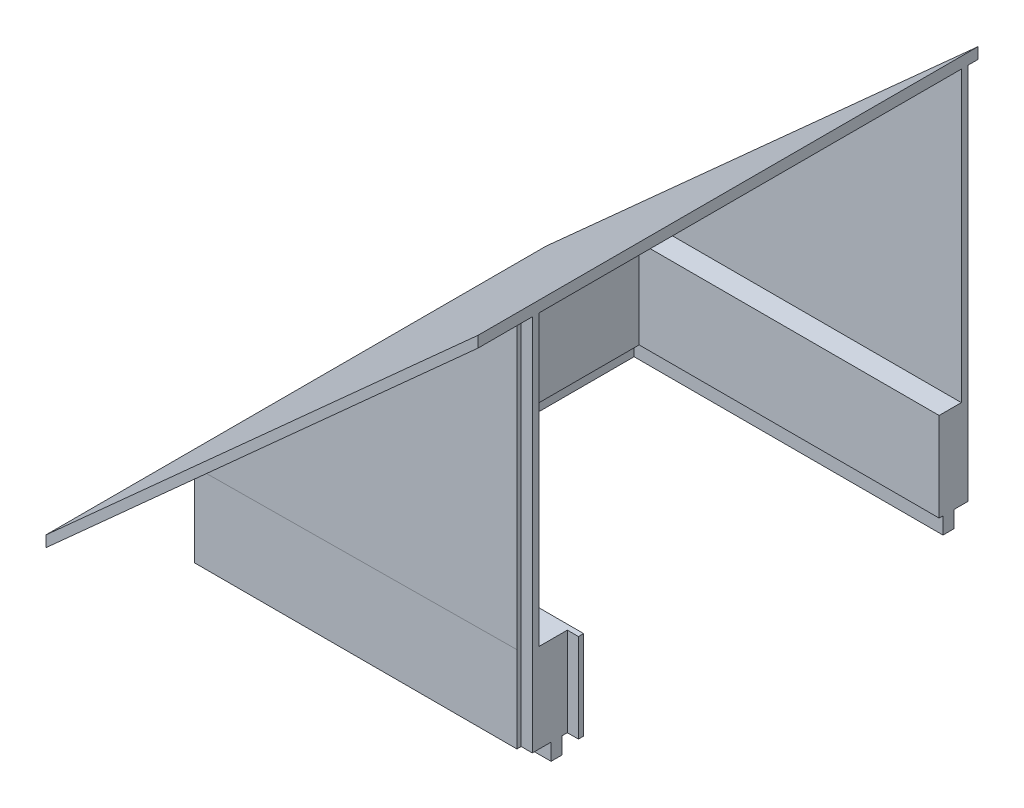
ISO-10303-21;
HEADER;
FILE_DESCRIPTION(('STEP AP214'),'2;1');
FILE_NAME('part.step','',(''),(''),'','','');
FILE_SCHEMA(('AUTOMOTIVE_DESIGN { 1 0 10303 214 1 1 1 1 }'));
ENDSEC;
DATA;
#1=APPLICATION_CONTEXT('core data for automotive mechanical design processes');
#2=APPLICATION_PROTOCOL_DEFINITION('international standard','automotive_design',2000,#1);
#3=PRODUCT_CONTEXT('',#1,'mechanical');
#4=PRODUCT('Part','Part','',(#3));
#5=PRODUCT_RELATED_PRODUCT_CATEGORY('part','',(#4));
#6=PRODUCT_DEFINITION_FORMATION('','',#4);
#7=PRODUCT_DEFINITION_CONTEXT('part definition',#1,'design');
#8=PRODUCT_DEFINITION('design','',#6,#7);
#9=PRODUCT_DEFINITION_SHAPE('','',#8);
#10=(LENGTH_UNIT() NAMED_UNIT(*) SI_UNIT(.MILLI.,.METRE.));
#11=(NAMED_UNIT(*) PLANE_ANGLE_UNIT() SI_UNIT($,.RADIAN.));
#12=(NAMED_UNIT(*) SI_UNIT($,.STERADIAN.) SOLID_ANGLE_UNIT());
#13=UNCERTAINTY_MEASURE_WITH_UNIT(LENGTH_MEASURE(1.E-05),#10,'distance_accuracy_value','');
#14=(GEOMETRIC_REPRESENTATION_CONTEXT(3) GLOBAL_UNCERTAINTY_ASSIGNED_CONTEXT((#13)) GLOBAL_UNIT_ASSIGNED_CONTEXT((#10,
#11,#12)) REPRESENTATION_CONTEXT('',''));
#15=CARTESIAN_POINT('',(0.,0.,0.));
#16=DIRECTION('',(0.,0.,1.));
#17=DIRECTION('',(1.,0.,0.));
#18=AXIS2_PLACEMENT_3D('',#15,#16,#17);
#19=CARTESIAN_POINT('',(24.3191489361702,0.,0.));
#20=DIRECTION('',(1.,0.,0.));
#21=DIRECTION('',(0.,0.,-1.));
#22=AXIS2_PLACEMENT_3D('',#19,#20,#21);
#23=PLANE('',#22);
#24=DIRECTION('',(0.,-1.,0.));
#25=VECTOR('',#24,1.);
#26=CARTESIAN_POINT('',(24.3191489361702,7.62,71.0236193905439));
#27=LINE('',#26,#25);
#28=CARTESIAN_POINT('',(24.3191489361702,7.62,71.0236193905439));
#29=VERTEX_POINT('',#28);
#30=CARTESIAN_POINT('',(24.3191489361702,-12.7,71.0236193905439));
#31=VERTEX_POINT('',#30);
#32=EDGE_CURVE('E50',#29,#31,#27,.T.);
#33=ORIENTED_EDGE('',*,*,#32,.F.);
#34=DIRECTION('',(0.,0.,-1.));
#35=VECTOR('',#34,1.);
#36=CARTESIAN_POINT('',(24.3191489361702,7.62,0.));
#37=LINE('',#36,#35);
#38=CARTESIAN_POINT('',(24.3191489361702,7.62,77.4653181557259));
#39=VERTEX_POINT('',#38);
#40=EDGE_CURVE('E476',#39,#29,#37,.T.);
#41=ORIENTED_EDGE('',*,*,#40,.F.);
#42=DIRECTION('',(0.,-0.99999991536576,-0.00041142249855091));
#43=VECTOR('',#42,1.);
#44=CARTESIAN_POINT('',(24.3191489361702,-0.0329146952814137,77.4621695741743));
#45=LINE('',#44,#43);
#46=CARTESIAN_POINT('',(24.3191489361703,73.66,77.4924884998297));
#47=VERTEX_POINT('',#46);
#48=EDGE_CURVE('E457',#47,#39,#45,.T.);
#49=ORIENTED_EDGE('',*,*,#48,.F.);
#50=DIRECTION('',(0.,0.,1.));
#51=VECTOR('',#50,1.);
#52=CARTESIAN_POINT('',(24.3191489361703,73.66,91.4350593905439));
#53=LINE('',#52,#51);
#54=CARTESIAN_POINT('',(24.3191489361702,73.6599999999999,-19.0549406094561));
#55=VERTEX_POINT('',#54);
#56=EDGE_CURVE('E366',#55,#47,#53,.T.);
#57=ORIENTED_EDGE('',*,*,#56,.F.);
#58=DIRECTION('',(0.,1.,0.));
#59=VECTOR('',#58,1.);
#60=CARTESIAN_POINT('',(24.3191489361702,0.,-19.0549406094561));
#61=LINE('',#60,#59);
#62=CARTESIAN_POINT('',(24.3191489361702,7.62,-19.0549406094561));
#63=VERTEX_POINT('',#62);
#64=EDGE_CURVE('E449',#63,#55,#61,.T.);
#65=ORIENTED_EDGE('',*,*,#64,.F.);
#66=CARTESIAN_POINT('',(24.3191489361702,7.62,-13.9749406094561));
#67=VERTEX_POINT('',#66);
#68=EDGE_CURVE('E470',#67,#63,#37,.T.);
#69=ORIENTED_EDGE('',*,*,#68,.F.);
#70=DIRECTION('',(0.,1.,0.));
#71=VECTOR('',#70,1.);
#72=CARTESIAN_POINT('',(24.3191489361702,7.62,-13.9749406094561));
#73=LINE('',#72,#71);
#74=CARTESIAN_POINT('',(24.3191489361702,-12.7,-13.9749406094561));
#75=VERTEX_POINT('',#74);
#76=EDGE_CURVE('E467',#75,#67,#73,.T.);
#77=ORIENTED_EDGE('',*,*,#76,.F.);
#78=DIRECTION('',(0.,0.,-1.));
#79=VECTOR('',#78,1.);
#80=CARTESIAN_POINT('',(24.3191489361702,-12.7,0.));
#81=LINE('',#80,#79);
#82=CARTESIAN_POINT('',(24.3191489361702,-12.7,-14.8568266094561));
#83=VERTEX_POINT('',#82);
#84=EDGE_CURVE('E486',#75,#83,#81,.T.);
#85=ORIENTED_EDGE('',*,*,#84,.T.);
#86=DIRECTION('',(0.,1.,0.));
#87=VECTOR('',#86,1.);
#88=CARTESIAN_POINT('',(24.3191489361702,-16.51,-14.8568266094561));
#89=LINE('',#88,#87);
#90=CARTESIAN_POINT('',(24.3191489361702,-16.51,-14.8568266094561));
#91=VERTEX_POINT('',#90);
#92=EDGE_CURVE('E454',#91,#83,#89,.T.);
#93=ORIENTED_EDGE('',*,*,#92,.F.);
#94=DIRECTION('',(0.,0.,1.));
#95=VECTOR('',#94,1.);
#96=CARTESIAN_POINT('',(24.3191489361702,-16.51,0.));
#97=LINE('',#96,#95);
#98=CARTESIAN_POINT('',(24.3191489361702,-16.51,-17.3968266094561));
#99=VERTEX_POINT('',#98);
#100=EDGE_CURVE('E459',#99,#91,#97,.T.);
#101=ORIENTED_EDGE('',*,*,#100,.F.);
#102=DIRECTION('',(0.,1.,0.));
#103=VECTOR('',#102,1.);
#104=CARTESIAN_POINT('',(24.3191489361702,-16.51,-17.3968266094561));
#105=LINE('',#104,#103);
#106=CARTESIAN_POINT('',(24.3191489361702,-12.7,-17.3968266094561));
#107=VERTEX_POINT('',#106);
#108=EDGE_CURVE('E492',#99,#107,#105,.T.);
#109=ORIENTED_EDGE('',*,*,#108,.T.);
#110=DIRECTION('',(0.,0.,-1.));
#111=VECTOR('',#110,1.);
#112=CARTESIAN_POINT('',(24.3191489361702,-12.7,0.));
#113=LINE('',#112,#111);
#114=CARTESIAN_POINT('',(24.3191489361702,-12.7,-20.594940609456));
#115=VERTEX_POINT('',#114);
#116=EDGE_CURVE('E482',#107,#115,#113,.T.);
#117=ORIENTED_EDGE('',*,*,#116,.T.);
#118=DIRECTION('',(0.,-1.,0.));
#119=VECTOR('',#118,1.);
#120=CARTESIAN_POINT('',(24.3191489361702,73.6599999999999,-20.594940609456));
#121=LINE('',#120,#119);
#122=CARTESIAN_POINT('',(24.3191489361702,73.6599999999999,-20.594940609456));
#123=VERTEX_POINT('',#122);
#124=EDGE_CURVE('E320',#123,#115,#121,.T.);
#125=ORIENTED_EDGE('',*,*,#124,.F.);
#126=DIRECTION('',(0.,0.,1.));
#127=VECTOR('',#126,1.);
#128=CARTESIAN_POINT('',(24.3191489361702,73.6599999999999,-21.594940609456));
#129=LINE('',#128,#127);
#130=CARTESIAN_POINT('',(24.3191489361702,73.6599999999999,-21.594940609456));
#131=VERTEX_POINT('',#130);
#132=EDGE_CURVE('E285',#131,#123,#129,.T.);
#133=ORIENTED_EDGE('',*,*,#132,.F.);
#134=CARTESIAN_POINT('',(24.3191489361702,73.6599999999999,-22.8649406094561));
#135=VERTEX_POINT('',#134);
#136=EDGE_CURVE('E371',#135,#131,#53,.T.);
#137=ORIENTED_EDGE('',*,*,#136,.F.);
#138=DIRECTION('',(0.,-1.,0.));
#139=VECTOR('',#138,1.);
#140=CARTESIAN_POINT('',(24.3191489361702,-12.7,-22.8649406094561));
#141=LINE('',#140,#139);
#142=CARTESIAN_POINT('',(24.3191489361702,76.1999999999999,-22.8649406094561));
#143=VERTEX_POINT('',#142);
#144=EDGE_CURVE('E460',#143,#135,#141,.T.);
#145=ORIENTED_EDGE('',*,*,#144,.F.);
#146=DIRECTION('',(0.,0.,1.));
#147=VECTOR('',#146,1.);
#148=CARTESIAN_POINT('',(24.3191489361703,76.2,91.4350593905439));
#149=LINE('',#148,#147);
#150=CARTESIAN_POINT('',(24.3191489361703,76.2,91.4350593905439));
#151=VERTEX_POINT('',#150);
#152=EDGE_CURVE('E336',#143,#151,#149,.T.);
#153=ORIENTED_EDGE('',*,*,#152,.T.);
#154=DIRECTION('',(0.,1.,0.));
#155=VECTOR('',#154,1.);
#156=CARTESIAN_POINT('',(24.3191489361702,-12.7,91.4350593905439));
#157=LINE('',#156,#155);
#158=CARTESIAN_POINT('',(24.3191489361703,73.66,91.4350593905439));
#159=VERTEX_POINT('',#158);
#160=EDGE_CURVE('E363',#159,#151,#157,.T.);
#161=ORIENTED_EDGE('',*,*,#160,.F.);
#162=CARTESIAN_POINT('',(24.3191489361702,73.66,80.0324884998297));
#163=VERTEX_POINT('',#162);
#164=EDGE_CURVE('E357',#163,#159,#53,.T.);
#165=ORIENTED_EDGE('',*,*,#164,.F.);
#166=DIRECTION('',(0.,0.,1.));
#167=VECTOR('',#166,1.);
#168=CARTESIAN_POINT('',(24.3191489361702,73.66,80.0324884998297));
#169=LINE('',#168,#167);
#170=CARTESIAN_POINT('',(24.3191489361702,73.6599999999999,79.0324884998297));
#171=VERTEX_POINT('',#170);
#172=EDGE_CURVE('E290',#171,#163,#169,.T.);
#173=ORIENTED_EDGE('',*,*,#172,.F.);
#174=DIRECTION('',(0.,1.,0.));
#175=VECTOR('',#174,1.);
#176=CARTESIAN_POINT('',(24.3191489361702,73.6599999999999,79.0324884998297));
#177=LINE('',#176,#175);
#178=CARTESIAN_POINT('',(24.3191489361702,-12.7,79.0324884998297));
#179=VERTEX_POINT('',#178);
#180=EDGE_CURVE('E299',#179,#171,#177,.T.);
#181=ORIENTED_EDGE('',*,*,#180,.F.);
#182=CARTESIAN_POINT('',(24.3191489361702,-12.7,74.7421793905439));
#183=VERTEX_POINT('',#182);
#184=EDGE_CURVE('E481',#179,#183,#113,.T.);
#185=ORIENTED_EDGE('',*,*,#184,.T.);
#186=DIRECTION('',(0.,-1.,0.));
#187=VECTOR('',#186,1.);
#188=CARTESIAN_POINT('',(24.3191489361702,-16.51,74.7421793905439));
#189=LINE('',#188,#187);
#190=CARTESIAN_POINT('',(24.3191489361702,-16.51,74.7421793905439));
#191=VERTEX_POINT('',#190);
#192=EDGE_CURVE('E489',#183,#191,#189,.T.);
#193=ORIENTED_EDGE('',*,*,#192,.T.);
#194=CARTESIAN_POINT('',(24.3191489361702,-16.51,72.2021793905439));
#195=VERTEX_POINT('',#194);
#196=EDGE_CURVE('E542',#195,#191,#97,.T.);
#197=ORIENTED_EDGE('',*,*,#196,.F.);
#198=DIRECTION('',(0.,-1.,0.));
#199=VECTOR('',#198,1.);
#200=CARTESIAN_POINT('',(24.3191489361702,-16.51,72.2021793905439));
#201=LINE('',#200,#199);
#202=CARTESIAN_POINT('',(24.3191489361702,-12.7,72.2021793905439));
#203=VERTEX_POINT('',#202);
#204=EDGE_CURVE('E541',#203,#195,#201,.T.);
#205=ORIENTED_EDGE('',*,*,#204,.F.);
#206=EDGE_CURVE('E485',#203,#31,#81,.T.);
#207=ORIENTED_EDGE('',*,*,#206,.T.);
#208=EDGE_LOOP('',(#33,#41,#49,#57,#65,#69,#77,#85,#93,#101,#109,#117,#125,#133,#137,#145,#153,
#161,#165,#173,#181,#185,#193,#197,#205,#207));
#209=FACE_BOUND('',#208,.T.);
#210=ADVANCED_FACE('F33',(#209),#23,.T.);
#211=CARTESIAN_POINT('',(-51.8808510638297,7.62,80.0050593905439));
#212=DIRECTION('',(0.,0.,-1.));
#213=DIRECTION('',(-1.,0.,0.));
#214=AXIS2_PLACEMENT_3D('',#211,#212,#213);
#215=PLANE('',#214);
#216=DIRECTION('',(-1.,0.,0.));
#217=VECTOR('',#216,1.);
#218=CARTESIAN_POINT('',(-51.8808510638297,-12.7,80.0050593905439));
#219=LINE('',#218,#217);
#220=CARTESIAN_POINT('',(21.7791489361702,-12.7,80.0050593905439));
#221=VERTEX_POINT('',#220);
#222=CARTESIAN_POINT('',(-51.8808510638297,-12.7,80.0050593905439));
#223=VERTEX_POINT('',#222);
#224=EDGE_CURVE('E259',#221,#223,#219,.T.);
#225=ORIENTED_EDGE('',*,*,#224,.F.);
#226=DIRECTION('',(0.,1.,0.));
#227=VECTOR('',#226,1.);
#228=CARTESIAN_POINT('',(21.7791489361702,7.62,80.0050593905439));
#229=LINE('',#228,#227);
#230=CARTESIAN_POINT('',(21.7791489361701,6.96927619047617,80.0050593905439));
#231=VERTEX_POINT('',#230);
#232=EDGE_CURVE('E58',#221,#231,#229,.T.);
#233=ORIENTED_EDGE('',*,*,#232,.T.);
#234=DIRECTION('',(0.999963267330155,0.00857111371997301,0.));
#235=VECTOR('',#234,1.);
#236=CARTESIAN_POINT('',(-50.4697399527186,6.34999999999996,80.0050593905439));
#237=LINE('',#236,#235);
#238=CARTESIAN_POINT('',(-50.4697399527186,6.34999999999995,80.0050593905439));
#239=VERTEX_POINT('',#238);
#240=EDGE_CURVE('E431',#239,#231,#237,.T.);
#241=ORIENTED_EDGE('',*,*,#240,.F.);
#242=DIRECTION('',(0.743294146247166,0.66896473162245,0.));
#243=VECTOR('',#242,1.);
#244=CARTESIAN_POINT('',(-50.6178676384154,6.21668508287291,80.0050593905439));
#245=LINE('',#244,#243);
#246=CARTESIAN_POINT('',(-51.8808510638297,5.07999999999997,80.0050593905439));
#247=VERTEX_POINT('',#246);
#248=EDGE_CURVE('E376',#247,#239,#245,.T.);
#249=ORIENTED_EDGE('',*,*,#248,.F.);
#250=DIRECTION('',(0.,-1.,0.));
#251=VECTOR('',#250,1.);
#252=CARTESIAN_POINT('',(-51.8808510638297,7.62,80.0050593905439));
#253=LINE('',#252,#251);
#254=EDGE_CURVE('E378',#247,#223,#253,.T.);
#255=ORIENTED_EDGE('',*,*,#254,.T.);
#256=EDGE_LOOP('',(#225,#233,#241,#249,#255));
#257=FACE_BOUND('',#256,.T.);
#258=ADVANCED_FACE('F648',(#257),#215,.F.);
#259=CARTESIAN_POINT('',(-27.0063477136475,27.4670530151639,0.));
#260=DIRECTION('',(-0.66896473162245,0.743294146247166,0.));
#261=DIRECTION('',(-0.743294146247166,-0.66896473162245,0.));
#262=AXIS2_PLACEMENT_3D('',#259,#260,#261);
#263=PLANE('',#262);
#264=DIRECTION('',(0.,0.,1.));
#265=VECTOR('',#264,1.);
#266=CARTESIAN_POINT('',(21.7791489361702,71.3739999999999,0.));
#267=LINE('',#266,#265);
#268=CARTESIAN_POINT('',(21.7791489361702,71.3739999999999,80.0315569451747));
#269=VERTEX_POINT('',#268);
#270=CARTESIAN_POINT('',(21.7791489361702,71.3739999999999,80.0317624351721));
#271=VERTEX_POINT('',#270);
#272=EDGE_CURVE('E329',#269,#271,#267,.T.);
#273=ORIENTED_EDGE('',*,*,#272,.T.);
#274=DIRECTION('',(0.743294129469356,0.66896471652242,0.000212472282512944));
#275=VECTOR('',#274,1.);
#276=CARTESIAN_POINT('',(-27.0189848794958,27.4556795659005,80.0178133799286));
#277=LINE('',#276,#275);
#278=EDGE_CURVE('E333',#271,#163,#277,.T.);
#279=ORIENTED_EDGE('',*,*,#278,.T.);
#280=ORIENTED_EDGE('',*,*,#164,.T.);
#281=DIRECTION('',(-0.743294146247166,-0.66896473162245,0.));
#282=VECTOR('',#281,1.);
#283=CARTESIAN_POINT('',(-74.4586288416075,-15.24,91.4350593905439));
#284=LINE('',#283,#282);
#285=CARTESIAN_POINT('',(-74.4586288416075,-15.24,91.4350593905439));
#286=VERTEX_POINT('',#285);
#287=EDGE_CURVE('E423',#159,#286,#284,.T.);
#288=ORIENTED_EDGE('',*,*,#287,.T.);
#289=DIRECTION('',(0.,0.,-1.));
#290=VECTOR('',#289,1.);
#291=CARTESIAN_POINT('',(-74.4586288416075,-15.24,91.4350593905439));
#292=LINE('',#291,#290);
#293=CARTESIAN_POINT('',(-74.4586288416075,-15.24,-22.8649406094561));
#294=VERTEX_POINT('',#293);
#295=EDGE_CURVE('E408',#286,#294,#292,.T.);
#296=ORIENTED_EDGE('',*,*,#295,.T.);
#297=DIRECTION('',(0.743294146247166,0.66896473162245,0.));
#298=VECTOR('',#297,1.);
#299=CARTESIAN_POINT('',(-74.4586288416075,-15.24,-22.8649406094561));
#300=LINE('',#299,#298);
#301=EDGE_CURVE('E989',#294,#135,#300,.T.);
#302=ORIENTED_EDGE('',*,*,#301,.T.);
#303=ORIENTED_EDGE('',*,*,#136,.T.);
#304=DIRECTION('',(-0.743294146247166,-0.66896473162245,0.));
#305=VECTOR('',#304,1.);
#306=CARTESIAN_POINT('',(-50.6178676384154,6.2166850828729,-21.5949406094561));
#307=LINE('',#306,#305);
#308=CARTESIAN_POINT('',(21.7791489361702,71.3739999999998,-21.594940609456));
#309=VERTEX_POINT('',#308);
#310=EDGE_CURVE('E398',#131,#309,#307,.T.);
#311=ORIENTED_EDGE('',*,*,#310,.T.);
#312=CARTESIAN_POINT('',(-51.8808510638297,5.07999999999995,-21.5949406094561));
#313=VERTEX_POINT('',#312);
#314=EDGE_CURVE('E445',#309,#313,#307,.T.);
#315=ORIENTED_EDGE('',*,*,#314,.T.);
#316=DIRECTION('',(0.,0.,1.));
#317=VECTOR('',#316,1.);
#318=CARTESIAN_POINT('',(-51.8808510638297,5.07999999999995,-21.5949406094561));
#319=LINE('',#318,#317);
#320=EDGE_CURVE('E397',#313,#247,#319,.T.);
#321=ORIENTED_EDGE('',*,*,#320,.T.);
#322=ORIENTED_EDGE('',*,*,#248,.T.);
#323=DIRECTION('',(-0.743294118628585,-0.668964706765727,-0.000272605943399204));
#324=VECTOR('',#323,1.);
#325=CARTESIAN_POINT('',(24.3191489361702,73.66,80.0324884998297));
#326=LINE('',#325,#324);
#327=EDGE_CURVE('E432',#269,#239,#326,.T.);
#328=ORIENTED_EDGE('',*,*,#327,.F.);
#329=EDGE_LOOP('',(#273,#279,#280,#288,#296,#302,#303,#311,#315,#321,#322,#328));
#330=FACE_BOUND('',#329,.T.);
#331=ADVANCED_FACE('F356',(#330),#263,.F.);
#332=CARTESIAN_POINT('',(0.000282126261983368,-0.0329147305649886,80.0022553341294));
#333=DIRECTION('',(-3.52647855895777E-06,0.000411422498548352,-0.999999915359542));
#334=DIRECTION('',(0.,0.99999991536576,0.00041142249855091));
#335=AXIS2_PLACEMENT_3D('',#332,#333,#334);
#336=PLANE('',#335);
#337=ORIENTED_EDGE('',*,*,#240,.T.);
#338=DIRECTION('',(0.,0.99999991536576,0.00041142249855091));
#339=VECTOR('',#338,1.);
#340=CARTESIAN_POINT('',(21.7791489361702,-0.032914698966627,80.0021785314291));
#341=LINE('',#340,#339);
#342=EDGE_CURVE('E326',#231,#269,#341,.T.);
#343=ORIENTED_EDGE('',*,*,#342,.T.);
#344=ORIENTED_EDGE('',*,*,#327,.T.);
#345=EDGE_LOOP('',(#337,#343,#344));
#346=FACE_BOUND('',#345,.T.);
#347=ADVANCED_FACE('F655',(#346),#336,.F.);
#348=CARTESIAN_POINT('',(-74.4586288416075,-12.7,-22.8649406094561));
#349=DIRECTION('',(0.,0.,-1.));
#350=DIRECTION('',(-1.,0.,0.));
#351=AXIS2_PLACEMENT_3D('',#348,#349,#350);
#352=PLANE('',#351);
#353=DIRECTION('',(0.743294146247166,0.66896473162245,0.));
#354=VECTOR('',#353,1.);
#355=CARTESIAN_POINT('',(-74.4586288416075,-12.7,-22.8649406094561));
#356=LINE('',#355,#354);
#357=CARTESIAN_POINT('',(-74.4586288416075,-12.7,-22.8649406094561));
#358=VERTEX_POINT('',#357);
#359=EDGE_CURVE('E413',#358,#143,#356,.T.);
#360=ORIENTED_EDGE('',*,*,#359,.T.);
#361=ORIENTED_EDGE('',*,*,#144,.T.);
#362=ORIENTED_EDGE('',*,*,#301,.F.);
#363=DIRECTION('',(0.,-1.,0.));
#364=VECTOR('',#363,1.);
#365=CARTESIAN_POINT('',(-74.4586288416075,-12.7,-22.8649406094561));
#366=LINE('',#365,#364);
#367=EDGE_CURVE('E987',#358,#294,#366,.T.);
#368=ORIENTED_EDGE('',*,*,#367,.F.);
#369=EDGE_LOOP('',(#360,#361,#362,#368));
#370=FACE_BOUND('',#369,.T.);
#371=ADVANCED_FACE('F671',(#370),#352,.T.);
#372=CARTESIAN_POINT('',(-74.4586288416075,-12.7,91.4350593905439));
#373=DIRECTION('',(0.,0.,1.));
#374=DIRECTION('',(1.,0.,0.));
#375=AXIS2_PLACEMENT_3D('',#372,#373,#374);
#376=PLANE('',#375);
#377=ORIENTED_EDGE('',*,*,#287,.F.);
#378=ORIENTED_EDGE('',*,*,#160,.T.);
#379=DIRECTION('',(-0.743294146247166,-0.66896473162245,0.));
#380=VECTOR('',#379,1.);
#381=CARTESIAN_POINT('',(-74.4586288416075,-12.7,91.4350593905439));
#382=LINE('',#381,#380);
#383=CARTESIAN_POINT('',(-74.4586288416075,-12.7,91.4350593905439));
#384=VERTEX_POINT('',#383);
#385=EDGE_CURVE('E369',#151,#384,#382,.T.);
#386=ORIENTED_EDGE('',*,*,#385,.T.);
#387=DIRECTION('',(0.,-1.,0.));
#388=VECTOR('',#387,1.);
#389=CARTESIAN_POINT('',(-74.4586288416075,-12.7,91.4350593905439));
#390=LINE('',#389,#388);
#391=EDGE_CURVE('E365',#384,#286,#390,.T.);
#392=ORIENTED_EDGE('',*,*,#391,.T.);
#393=EDGE_LOOP('',(#377,#378,#386,#392));
#394=FACE_BOUND('',#393,.T.);
#395=ADVANCED_FACE('F667',(#394),#376,.T.);
#396=CARTESIAN_POINT('',(-74.4586288416075,-12.7,91.4350593905439));
#397=DIRECTION('',(-1.,0.,0.));
#398=DIRECTION('',(0.,-1.,0.));
#399=AXIS2_PLACEMENT_3D('',#396,#397,#398);
#400=PLANE('',#399);
#401=ORIENTED_EDGE('',*,*,#295,.F.);
#402=ORIENTED_EDGE('',*,*,#391,.F.);
#403=DIRECTION('',(0.,0.,-1.));
#404=VECTOR('',#403,1.);
#405=CARTESIAN_POINT('',(-74.4586288416075,-12.7,91.4350593905439));
#406=LINE('',#405,#404);
#407=EDGE_CURVE('E404',#384,#358,#406,.T.);
#408=ORIENTED_EDGE('',*,*,#407,.T.);
#409=ORIENTED_EDGE('',*,*,#367,.T.);
#410=EDGE_LOOP('',(#401,#402,#408,#409));
#411=FACE_BOUND('',#410,.T.);
#412=ADVANCED_FACE('F670',(#411),#400,.T.);
#413=CARTESIAN_POINT('',(-27.0063477136475,30.0070530151639,0.));
#414=DIRECTION('',(-0.66896473162245,0.743294146247166,0.));
#415=DIRECTION('',(-0.743294146247166,-0.66896473162245,0.));
#416=AXIS2_PLACEMENT_3D('',#413,#414,#415);
#417=PLANE('',#416);
#418=ORIENTED_EDGE('',*,*,#407,.F.);
#419=ORIENTED_EDGE('',*,*,#385,.F.);
#420=ORIENTED_EDGE('',*,*,#152,.F.);
#421=ORIENTED_EDGE('',*,*,#359,.F.);
#422=EDGE_LOOP('',(#418,#419,#420,#421));
#423=FACE_BOUND('',#422,.T.);
#424=ADVANCED_FACE('F696',(#423),#417,.T.);
#425=CARTESIAN_POINT('',(-51.8808510638297,7.62,-21.5949406094561));
#426=DIRECTION('',(1.,0.,0.));
#427=DIRECTION('',(0.,0.,-1.));
#428=AXIS2_PLACEMENT_3D('',#425,#426,#427);
#429=PLANE('',#428);
#430=ORIENTED_EDGE('',*,*,#320,.F.);
#431=DIRECTION('',(0.,-1.,0.));
#432=VECTOR('',#431,1.);
#433=CARTESIAN_POINT('',(-51.8808510638297,7.62,-21.5949406094561));
#434=LINE('',#433,#432);
#435=CARTESIAN_POINT('',(-51.8808510638297,-12.7,-21.5949406094561));
#436=VERTEX_POINT('',#435);
#437=EDGE_CURVE('E603',#313,#436,#434,.T.);
#438=ORIENTED_EDGE('',*,*,#437,.T.);
#439=DIRECTION('',(0.,0.,-1.));
#440=VECTOR('',#439,1.);
#441=CARTESIAN_POINT('',(-51.8808510638297,-12.7,-21.5949406094561));
#442=LINE('',#441,#440);
#443=EDGE_CURVE('E503',#223,#436,#442,.T.);
#444=ORIENTED_EDGE('',*,*,#443,.F.);
#445=ORIENTED_EDGE('',*,*,#254,.F.);
#446=EDGE_LOOP('',(#430,#438,#444,#445));
#447=FACE_BOUND('',#446,.T.);
#448=ADVANCED_FACE('F693',(#447),#429,.F.);
#449=DIRECTION('',(0.,0.,1.));
#450=VECTOR('',#449,1.);
#451=CARTESIAN_POINT('',(-49.0586288416075,7.62,0.));
#452=LINE('',#451,#450);
#453=CARTESIAN_POINT('',(-49.0586288416075,7.62,-19.0549406094561));
#454=VERTEX_POINT('',#453);
#455=CARTESIAN_POINT('',(-49.0586288416075,7.61999999999999,77.4655769209078));
#456=VERTEX_POINT('',#455);
#457=EDGE_CURVE('E393',#454,#456,#452,.T.);
#458=ORIENTED_EDGE('',*,*,#457,.F.);
#459=DIRECTION('',(0.743294146247166,0.66896473162245,0.));
#460=VECTOR('',#459,1.);
#461=CARTESIAN_POINT('',(-49.0586288416075,7.62,-19.0549406094561));
#462=LINE('',#461,#460);
#463=EDGE_CURVE('E11',#454,#55,#462,.T.);
#464=ORIENTED_EDGE('',*,*,#463,.T.);
#465=ORIENTED_EDGE('',*,*,#56,.T.);
#466=DIRECTION('',(-0.743294118628585,-0.668964706765727,-0.000272605943399204));
#467=VECTOR('',#466,1.);
#468=CARTESIAN_POINT('',(24.3191489361702,73.66,77.4924884998297));
#469=LINE('',#468,#467);
#470=EDGE_CURVE('E428',#47,#456,#469,.T.);
#471=ORIENTED_EDGE('',*,*,#470,.T.);
#472=EDGE_LOOP('',(#458,#464,#465,#471));
#473=FACE_BOUND('',#472,.T.);
#474=ADVANCED_FACE('F634',(#473),#263,.F.);
#475=CARTESIAN_POINT('',(0.,7.62,0.));
#476=DIRECTION('',(0.,1.,0.));
#477=DIRECTION('',(0.,0.,1.));
#478=AXIS2_PLACEMENT_3D('',#475,#476,#477);
#479=PLANE('',#478);
#480=DIRECTION('',(-0.999999999993782,0.,3.52647885741862E-06));
#481=VECTOR('',#480,1.);
#482=CARTESIAN_POINT('',(0.000273180109091904,7.62,77.4654039157271));
#483=LINE('',#482,#481);
#484=EDGE_CURVE('E455',#39,#456,#483,.T.);
#485=ORIENTED_EDGE('',*,*,#484,.F.);
#486=ORIENTED_EDGE('',*,*,#40,.T.);
#487=DIRECTION('',(-1.,0.,0.));
#488=VECTOR('',#487,1.);
#489=CARTESIAN_POINT('',(26.8591489361702,7.62,71.0236193905439));
#490=LINE('',#489,#488);
#491=CARTESIAN_POINT('',(26.8591489361702,7.62,71.0236193905439));
#492=VERTEX_POINT('',#491);
#493=EDGE_CURVE('E267',#492,#29,#490,.T.);
#494=ORIENTED_EDGE('',*,*,#493,.F.);
#495=DIRECTION('',(0.,0.,1.));
#496=VECTOR('',#495,1.);
#497=CARTESIAN_POINT('',(26.8591489361702,7.62,69.8450593905439));
#498=LINE('',#497,#496);
#499=CARTESIAN_POINT('',(26.8591489361702,7.62,69.8450593905439));
#500=VERTEX_POINT('',#499);
#501=EDGE_CURVE('E263',#500,#492,#498,.T.);
#502=ORIENTED_EDGE('',*,*,#501,.F.);
#503=DIRECTION('',(1.,0.,0.));
#504=VECTOR('',#503,1.);
#505=CARTESIAN_POINT('',(92.8991489361703,7.62,69.8450593905439));
#506=LINE('',#505,#504);
#507=CARTESIAN_POINT('',(-44.2608510638297,7.62,69.8450593905439));
#508=VERTEX_POINT('',#507);
#509=EDGE_CURVE('E250',#508,#500,#506,.T.);
#510=ORIENTED_EDGE('',*,*,#509,.F.);
#511=DIRECTION('',(0.,0.,1.));
#512=VECTOR('',#511,1.);
#513=CARTESIAN_POINT('',(-44.2608510638297,7.62,-13.9749406094561));
#514=LINE('',#513,#512);
#515=CARTESIAN_POINT('',(-44.2608510638297,7.62,-13.9749406094561));
#516=VERTEX_POINT('',#515);
#517=EDGE_CURVE('E495',#516,#508,#514,.T.);
#518=ORIENTED_EDGE('',*,*,#517,.F.);
#519=DIRECTION('',(-1.,0.,0.));
#520=VECTOR('',#519,1.);
#521=CARTESIAN_POINT('',(-44.2608510638297,7.62,-13.9749406094561));
#522=LINE('',#521,#520);
#523=EDGE_CURVE('E260',#67,#516,#522,.T.);
#524=ORIENTED_EDGE('',*,*,#523,.F.);
#525=ORIENTED_EDGE('',*,*,#68,.T.);
#526=DIRECTION('',(-1.,0.,0.));
#527=VECTOR('',#526,1.);
#528=CARTESIAN_POINT('',(97.6969267139482,7.62,-19.0549406094561));
#529=LINE('',#528,#527);
#530=EDGE_CURVE('E42',#63,#454,#529,.T.);
#531=ORIENTED_EDGE('',*,*,#530,.T.);
#532=ORIENTED_EDGE('',*,*,#457,.T.);
#533=EDGE_LOOP('',(#485,#486,#494,#502,#510,#518,#524,#525,#531,#532));
#534=FACE_BOUND('',#533,.T.);
#535=ADVANCED_FACE('F265',(#534),#479,.T.);
#536=CARTESIAN_POINT('',(0.,0.,-19.0549406094561));
#537=DIRECTION('',(0.,0.,1.));
#538=DIRECTION('',(1.,0.,0.));
#539=AXIS2_PLACEMENT_3D('',#536,#537,#538);
#540=PLANE('',#539);
#541=ORIENTED_EDGE('',*,*,#530,.F.);
#542=ORIENTED_EDGE('',*,*,#64,.T.);
#543=ORIENTED_EDGE('',*,*,#463,.F.);
#544=EDGE_LOOP('',(#541,#542,#543));
#545=FACE_BOUND('',#544,.T.);
#546=ADVANCED_FACE('F35',(#545),#540,.T.);
#547=CARTESIAN_POINT('',(0.000282126261980978,-0.0329147305649917,77.4622553341294));
#548=DIRECTION('',(-3.52647855895777E-06,0.000411422498548352,-0.999999915359542));
#549=DIRECTION('',(0.,0.99999991536576,0.00041142249855091));
#550=AXIS2_PLACEMENT_3D('',#547,#548,#549);
#551=PLANE('',#550);
#552=ORIENTED_EDGE('',*,*,#470,.F.);
#553=ORIENTED_EDGE('',*,*,#48,.T.);
#554=ORIENTED_EDGE('',*,*,#484,.T.);
#555=EDGE_LOOP('',(#552,#553,#554));
#556=FACE_BOUND('',#555,.T.);
#557=ADVANCED_FACE('F637',(#556),#551,.T.);
#558=CARTESIAN_POINT('',(92.8991489361703,7.62,69.8450593905439));
#559=DIRECTION('',(0.,0.,-1.));
#560=DIRECTION('',(-1.,0.,0.));
#561=AXIS2_PLACEMENT_3D('',#558,#559,#560);
#562=PLANE('',#561);
#563=ORIENTED_EDGE('',*,*,#509,.T.);
#564=DIRECTION('',(0.,1.,0.));
#565=VECTOR('',#564,1.);
#566=CARTESIAN_POINT('',(26.8591489361702,7.62,69.8450593905439));
#567=LINE('',#566,#565);
#568=CARTESIAN_POINT('',(26.8591489361702,-12.7,69.8450593905439));
#569=VERTEX_POINT('',#568);
#570=EDGE_CURVE('E254',#569,#500,#567,.T.);
#571=ORIENTED_EDGE('',*,*,#570,.F.);
#572=DIRECTION('',(-1.,0.,0.));
#573=VECTOR('',#572,1.);
#574=CARTESIAN_POINT('',(92.8991489361703,-12.7,69.8450593905439));
#575=LINE('',#574,#573);
#576=CARTESIAN_POINT('',(-44.2608510638297,-12.7,69.8450593905439));
#577=VERTEX_POINT('',#576);
#578=EDGE_CURVE('E501',#569,#577,#575,.T.);
#579=ORIENTED_EDGE('',*,*,#578,.T.);
#580=DIRECTION('',(0.,-1.,0.));
#581=VECTOR('',#580,1.);
#582=CARTESIAN_POINT('',(-44.2608510638297,7.62,69.8450593905439));
#583=LINE('',#582,#581);
#584=EDGE_CURVE('E256',#508,#577,#583,.T.);
#585=ORIENTED_EDGE('',*,*,#584,.F.);
#586=EDGE_LOOP('',(#563,#571,#579,#585));
#587=FACE_BOUND('',#586,.T.);
#588=ADVANCED_FACE('F252',(#587),#562,.T.);
#589=CARTESIAN_POINT('',(-44.2608510638297,7.62,-13.9749406094561));
#590=DIRECTION('',(1.,0.,0.));
#591=DIRECTION('',(0.,0.,-1.));
#592=AXIS2_PLACEMENT_3D('',#589,#590,#591);
#593=PLANE('',#592);
#594=ORIENTED_EDGE('',*,*,#584,.T.);
#595=DIRECTION('',(0.,0.,-1.));
#596=VECTOR('',#595,1.);
#597=CARTESIAN_POINT('',(-44.2608510638297,-12.7,-13.9749406094561));
#598=LINE('',#597,#596);
#599=CARTESIAN_POINT('',(-44.2608510638297,-12.7,-13.9749406094561));
#600=VERTEX_POINT('',#599);
#601=EDGE_CURVE('E500',#577,#600,#598,.T.);
#602=ORIENTED_EDGE('',*,*,#601,.T.);
#603=DIRECTION('',(0.,-1.,0.));
#604=VECTOR('',#603,1.);
#605=CARTESIAN_POINT('',(-44.2608510638297,7.62,-13.9749406094561));
#606=LINE('',#605,#604);
#607=EDGE_CURVE('E613',#516,#600,#606,.T.);
#608=ORIENTED_EDGE('',*,*,#607,.F.);
#609=ORIENTED_EDGE('',*,*,#517,.T.);
#610=EDGE_LOOP('',(#594,#602,#608,#609));
#611=FACE_BOUND('',#610,.T.);
#612=ADVANCED_FACE('F623',(#611),#593,.T.);
#613=CARTESIAN_POINT('',(-44.2608510638297,7.62,-13.9749406094561));
#614=DIRECTION('',(0.,0.,1.));
#615=DIRECTION('',(1.,0.,0.));
#616=AXIS2_PLACEMENT_3D('',#613,#614,#615);
#617=PLANE('',#616);
#618=DIRECTION('',(1.,0.,0.));
#619=VECTOR('',#618,1.);
#620=CARTESIAN_POINT('',(-44.2608510638297,-12.7,-13.9749406094561));
#621=LINE('',#620,#619);
#622=EDGE_CURVE('E498',#600,#75,#621,.T.);
#623=ORIENTED_EDGE('',*,*,#622,.T.);
#624=ORIENTED_EDGE('',*,*,#76,.T.);
#625=ORIENTED_EDGE('',*,*,#523,.T.);
#626=ORIENTED_EDGE('',*,*,#607,.T.);
#627=EDGE_LOOP('',(#623,#624,#625,#626));
#628=FACE_BOUND('',#627,.T.);
#629=ADVANCED_FACE('F627',(#628),#617,.T.);
#630=CARTESIAN_POINT('',(0.,-12.7,0.));
#631=DIRECTION('',(0.,1.,0.));
#632=DIRECTION('',(0.,0.,1.));
#633=AXIS2_PLACEMENT_3D('',#630,#631,#632);
#634=PLANE('',#633);
#635=ORIENTED_EDGE('',*,*,#184,.F.);
#636=DIRECTION('',(1.,0.,0.));
#637=VECTOR('',#636,1.);
#638=CARTESIAN_POINT('',(21.7791489361702,-12.7,79.0324884998297));
#639=LINE('',#638,#637);
#640=CARTESIAN_POINT('',(21.7791489361702,-12.7,79.0324884998297));
#641=VERTEX_POINT('',#640);
#642=EDGE_CURVE('E298',#641,#179,#639,.T.);
#643=ORIENTED_EDGE('',*,*,#642,.F.);
#644=DIRECTION('',(0.,0.,-1.));
#645=VECTOR('',#644,1.);
#646=CARTESIAN_POINT('',(21.7791489361702,-12.7,79.0324884998297));
#647=LINE('',#646,#645);
#648=EDGE_CURVE('E289',#221,#641,#647,.T.);
#649=ORIENTED_EDGE('',*,*,#648,.F.);
#650=ORIENTED_EDGE('',*,*,#224,.T.);
#651=ORIENTED_EDGE('',*,*,#443,.T.);
#652=DIRECTION('',(1.,0.,0.));
#653=VECTOR('',#652,1.);
#654=CARTESIAN_POINT('',(-51.8808510638297,-12.7,-21.5949406094561));
#655=LINE('',#654,#653);
#656=CARTESIAN_POINT('',(21.7791489361702,-12.7,-21.5949406094561));
#657=VERTEX_POINT('',#656);
#658=EDGE_CURVE('E504',#436,#657,#655,.T.);
#659=ORIENTED_EDGE('',*,*,#658,.T.);
#660=DIRECTION('',(0.,0.,-1.));
#661=VECTOR('',#660,1.);
#662=CARTESIAN_POINT('',(21.7791489361702,-12.7,-21.594940609456));
#663=LINE('',#662,#661);
#664=CARTESIAN_POINT('',(21.7791489361702,-12.7,-20.594940609456));
#665=VERTEX_POINT('',#664);
#666=EDGE_CURVE('E317',#665,#657,#663,.T.);
#667=ORIENTED_EDGE('',*,*,#666,.F.);
#668=DIRECTION('',(1.,0.,0.));
#669=VECTOR('',#668,1.);
#670=CARTESIAN_POINT('',(21.7791489361702,-12.7,-20.594940609456));
#671=LINE('',#670,#669);
#672=EDGE_CURVE('E302',#665,#115,#671,.T.);
#673=ORIENTED_EDGE('',*,*,#672,.T.);
#674=ORIENTED_EDGE('',*,*,#116,.F.);
#675=DIRECTION('',(1.,0.,0.));
#676=VECTOR('',#675,1.);
#677=CARTESIAN_POINT('',(97.4791489361702,-12.7,-17.3968266094561));
#678=LINE('',#677,#676);
#679=CARTESIAN_POINT('',(-48.8408510638298,-12.7,-17.3968266094561));
#680=VERTEX_POINT('',#679);
#681=EDGE_CURVE('E513',#680,#107,#678,.T.);
#682=ORIENTED_EDGE('',*,*,#681,.F.);
#683=DIRECTION('',(0.,0.,-1.));
#684=VECTOR('',#683,1.);
#685=CARTESIAN_POINT('',(-48.8408510638298,-12.7,-17.3968266094561));
#686=LINE('',#685,#684);
#687=CARTESIAN_POINT('',(-48.8408510638298,-12.7,74.7421793905439));
#688=VERTEX_POINT('',#687);
#689=EDGE_CURVE('E515',#688,#680,#686,.T.);
#690=ORIENTED_EDGE('',*,*,#689,.F.);
#691=DIRECTION('',(-1.,0.,0.));
#692=VECTOR('',#691,1.);
#693=CARTESIAN_POINT('',(97.4791489361702,-12.7,74.7421793905439));
#694=LINE('',#693,#692);
#695=EDGE_CURVE('E516',#183,#688,#694,.T.);
#696=ORIENTED_EDGE('',*,*,#695,.F.);
#697=EDGE_LOOP('',(#635,#643,#649,#650,#651,#659,#667,#673,#674,#682,#690,#696));
#698=FACE_BOUND('',#697,.T.);
#699=ADVANCED_FACE('F581',(#698),#634,.F.);
#700=CARTESIAN_POINT('',(-48.8408510638298,-16.51,-17.3968266094561));
#701=DIRECTION('',(1.,0.,0.));
#702=DIRECTION('',(0.,0.,-1.));
#703=AXIS2_PLACEMENT_3D('',#700,#701,#702);
#704=PLANE('',#703);
#705=ORIENTED_EDGE('',*,*,#689,.T.);
#706=DIRECTION('',(0.,1.,0.));
#707=VECTOR('',#706,1.);
#708=CARTESIAN_POINT('',(-48.8408510638298,-16.51,-17.3968266094561));
#709=LINE('',#708,#707);
#710=CARTESIAN_POINT('',(-48.8408510638298,-16.51,-17.3968266094561));
#711=VERTEX_POINT('',#710);
#712=EDGE_CURVE('E510',#711,#680,#709,.T.);
#713=ORIENTED_EDGE('',*,*,#712,.F.);
#714=DIRECTION('',(0.,0.,-1.));
#715=VECTOR('',#714,1.);
#716=CARTESIAN_POINT('',(-48.8408510638298,-16.51,-17.3968266094561));
#717=LINE('',#716,#715);
#718=CARTESIAN_POINT('',(-48.8408510638298,-16.51,74.7421793905439));
#719=VERTEX_POINT('',#718);
#720=EDGE_CURVE('E509',#719,#711,#717,.T.);
#721=ORIENTED_EDGE('',*,*,#720,.F.);
#722=DIRECTION('',(0.,1.,0.));
#723=VECTOR('',#722,1.);
#724=CARTESIAN_POINT('',(-48.8408510638298,-16.51,74.7421793905439));
#725=LINE('',#724,#723);
#726=EDGE_CURVE('E436',#719,#688,#725,.T.);
#727=ORIENTED_EDGE('',*,*,#726,.T.);
#728=EDGE_LOOP('',(#705,#713,#721,#727));
#729=FACE_BOUND('',#728,.T.);
#730=ADVANCED_FACE('F572',(#729),#704,.F.);
#731=CARTESIAN_POINT('',(-46.3008510638298,-16.51,-14.8568266094561));
#732=DIRECTION('',(1.,0.,0.));
#733=DIRECTION('',(0.,0.,-1.));
#734=AXIS2_PLACEMENT_3D('',#731,#732,#733);
#735=PLANE('',#734);
#736=DIRECTION('',(0.,0.,-1.));
#737=VECTOR('',#736,1.);
#738=CARTESIAN_POINT('',(-46.3008510638298,-12.7,-14.8568266094561));
#739=LINE('',#738,#737);
#740=CARTESIAN_POINT('',(-46.3008510638298,-12.7,72.2021793905439));
#741=VERTEX_POINT('',#740);
#742=CARTESIAN_POINT('',(-46.3008510638298,-12.7,-14.8568266094561));
#743=VERTEX_POINT('',#742);
#744=EDGE_CURVE('E527',#741,#743,#739,.T.);
#745=ORIENTED_EDGE('',*,*,#744,.F.);
#746=DIRECTION('',(0.,1.,0.));
#747=VECTOR('',#746,1.);
#748=CARTESIAN_POINT('',(-46.3008510638298,-16.51,72.2021793905439));
#749=LINE('',#748,#747);
#750=CARTESIAN_POINT('',(-46.3008510638298,-16.51,72.2021793905439));
#751=VERTEX_POINT('',#750);
#752=EDGE_CURVE('E518',#751,#741,#749,.T.);
#753=ORIENTED_EDGE('',*,*,#752,.F.);
#754=DIRECTION('',(0.,0.,-1.));
#755=VECTOR('',#754,1.);
#756=CARTESIAN_POINT('',(-46.3008510638298,-16.51,-14.8568266094561));
#757=LINE('',#756,#755);
#758=CARTESIAN_POINT('',(-46.3008510638298,-16.51,-14.8568266094561));
#759=VERTEX_POINT('',#758);
#760=EDGE_CURVE('E522',#751,#759,#757,.T.);
#761=ORIENTED_EDGE('',*,*,#760,.T.);
#762=DIRECTION('',(0.,1.,0.));
#763=VECTOR('',#762,1.);
#764=CARTESIAN_POINT('',(-46.3008510638298,-16.51,-14.8568266094561));
#765=LINE('',#764,#763);
#766=EDGE_CURVE('E523',#759,#743,#765,.T.);
#767=ORIENTED_EDGE('',*,*,#766,.T.);
#768=EDGE_LOOP('',(#745,#753,#761,#767));
#769=FACE_BOUND('',#768,.T.);
#770=ADVANCED_FACE('F560',(#769),#735,.T.);
#771=ORIENTED_EDGE('',*,*,#206,.F.);
#772=DIRECTION('',(-1.,0.,0.));
#773=VECTOR('',#772,1.);
#774=CARTESIAN_POINT('',(94.9391489361702,-12.7,72.2021793905439));
#775=LINE('',#774,#773);
#776=EDGE_CURVE('E383',#203,#741,#775,.T.);
#777=ORIENTED_EDGE('',*,*,#776,.T.);
#778=ORIENTED_EDGE('',*,*,#744,.T.);
#779=DIRECTION('',(1.,0.,0.));
#780=VECTOR('',#779,1.);
#781=CARTESIAN_POINT('',(94.9391489361702,-12.7,-14.8568266094561));
#782=LINE('',#781,#780);
#783=EDGE_CURVE('E525',#743,#83,#782,.T.);
#784=ORIENTED_EDGE('',*,*,#783,.T.);
#785=ORIENTED_EDGE('',*,*,#84,.F.);
#786=ORIENTED_EDGE('',*,*,#622,.F.);
#787=ORIENTED_EDGE('',*,*,#601,.F.);
#788=ORIENTED_EDGE('',*,*,#578,.F.);
#789=DIRECTION('',(0.,0.,-1.));
#790=VECTOR('',#789,1.);
#791=CARTESIAN_POINT('',(26.8591489361702,-12.7,69.8450593905439));
#792=LINE('',#791,#790);
#793=CARTESIAN_POINT('',(26.8591489361702,-12.7,71.0236193905439));
#794=VERTEX_POINT('',#793);
#795=EDGE_CURVE('E275',#794,#569,#792,.T.);
#796=ORIENTED_EDGE('',*,*,#795,.F.);
#797=DIRECTION('',(-1.,0.,0.));
#798=VECTOR('',#797,1.);
#799=CARTESIAN_POINT('',(26.8591489361702,-12.7,71.0236193905439));
#800=LINE('',#799,#798);
#801=EDGE_CURVE('E280',#794,#31,#800,.T.);
#802=ORIENTED_EDGE('',*,*,#801,.T.);
#803=EDGE_LOOP('',(#771,#777,#778,#784,#785,#786,#787,#788,#796,#802));
#804=FACE_BOUND('',#803,.T.);
#805=ADVANCED_FACE('F626',(#804),#634,.F.);
#806=CARTESIAN_POINT('',(0.,-16.51,0.));
#807=DIRECTION('',(0.,-1.,0.));
#808=DIRECTION('',(0.,0.,-1.));
#809=AXIS2_PLACEMENT_3D('',#806,#807,#808);
#810=PLANE('',#809);
#811=DIRECTION('',(1.,0.,0.));
#812=VECTOR('',#811,1.);
#813=CARTESIAN_POINT('',(97.4791489361702,-16.51,-17.3968266094561));
#814=LINE('',#813,#812);
#815=EDGE_CURVE('E507',#711,#99,#814,.T.);
#816=ORIENTED_EDGE('',*,*,#815,.T.);
#817=ORIENTED_EDGE('',*,*,#100,.T.);
#818=DIRECTION('',(1.,0.,0.));
#819=VECTOR('',#818,1.);
#820=CARTESIAN_POINT('',(94.9391489361702,-16.51,-14.8568266094561));
#821=LINE('',#820,#819);
#822=EDGE_CURVE('E519',#759,#91,#821,.T.);
#823=ORIENTED_EDGE('',*,*,#822,.F.);
#824=ORIENTED_EDGE('',*,*,#760,.F.);
#825=DIRECTION('',(-1.,0.,0.));
#826=VECTOR('',#825,1.);
#827=CARTESIAN_POINT('',(94.9391489361702,-16.51,72.2021793905439));
#828=LINE('',#827,#826);
#829=EDGE_CURVE('E524',#195,#751,#828,.T.);
#830=ORIENTED_EDGE('',*,*,#829,.F.);
#831=ORIENTED_EDGE('',*,*,#196,.T.);
#832=DIRECTION('',(-1.,0.,0.));
#833=VECTOR('',#832,1.);
#834=CARTESIAN_POINT('',(97.4791489361702,-16.51,74.7421793905439));
#835=LINE('',#834,#833);
#836=EDGE_CURVE('E511',#191,#719,#835,.T.);
#837=ORIENTED_EDGE('',*,*,#836,.T.);
#838=ORIENTED_EDGE('',*,*,#720,.T.);
#839=EDGE_LOOP('',(#816,#817,#823,#824,#830,#831,#837,#838));
#840=FACE_BOUND('',#839,.T.);
#841=ADVANCED_FACE('F552',(#840),#810,.T.);
#842=CARTESIAN_POINT('',(94.9391489361702,-16.51,-14.8568266094561));
#843=DIRECTION('',(0.,0.,1.));
#844=DIRECTION('',(1.,0.,0.));
#845=AXIS2_PLACEMENT_3D('',#842,#843,#844);
#846=PLANE('',#845);
#847=ORIENTED_EDGE('',*,*,#822,.T.);
#848=ORIENTED_EDGE('',*,*,#92,.T.);
#849=ORIENTED_EDGE('',*,*,#783,.F.);
#850=ORIENTED_EDGE('',*,*,#766,.F.);
#851=EDGE_LOOP('',(#847,#848,#849,#850));
#852=FACE_BOUND('',#851,.T.);
#853=ADVANCED_FACE('F557',(#852),#846,.T.);
#854=CARTESIAN_POINT('',(94.9391489361702,-16.51,72.2021793905439));
#855=DIRECTION('',(0.,0.,-1.));
#856=DIRECTION('',(-1.,0.,0.));
#857=AXIS2_PLACEMENT_3D('',#854,#855,#856);
#858=PLANE('',#857);
#859=ORIENTED_EDGE('',*,*,#776,.F.);
#860=ORIENTED_EDGE('',*,*,#204,.T.);
#861=ORIENTED_EDGE('',*,*,#829,.T.);
#862=ORIENTED_EDGE('',*,*,#752,.T.);
#863=EDGE_LOOP('',(#859,#860,#861,#862));
#864=FACE_BOUND('',#863,.T.);
#865=ADVANCED_FACE('F562',(#864),#858,.T.);
#866=CARTESIAN_POINT('',(97.4791489361702,-16.51,-17.3968266094561));
#867=DIRECTION('',(0.,0.,1.));
#868=DIRECTION('',(1.,0.,0.));
#869=AXIS2_PLACEMENT_3D('',#866,#867,#868);
#870=PLANE('',#869);
#871=ORIENTED_EDGE('',*,*,#108,.F.);
#872=ORIENTED_EDGE('',*,*,#815,.F.);
#873=ORIENTED_EDGE('',*,*,#712,.T.);
#874=ORIENTED_EDGE('',*,*,#681,.T.);
#875=EDGE_LOOP('',(#871,#872,#873,#874));
#876=FACE_BOUND('',#875,.T.);
#877=ADVANCED_FACE('F584',(#876),#870,.F.);
#878=CARTESIAN_POINT('',(97.4791489361702,-16.51,74.7421793905439));
#879=DIRECTION('',(0.,0.,-1.));
#880=DIRECTION('',(-1.,0.,0.));
#881=AXIS2_PLACEMENT_3D('',#878,#879,#880);
#882=PLANE('',#881);
#883=ORIENTED_EDGE('',*,*,#192,.F.);
#884=ORIENTED_EDGE('',*,*,#695,.T.);
#885=ORIENTED_EDGE('',*,*,#726,.F.);
#886=ORIENTED_EDGE('',*,*,#836,.F.);
#887=EDGE_LOOP('',(#883,#884,#885,#886));
#888=FACE_BOUND('',#887,.T.);
#889=ADVANCED_FACE('F577',(#888),#882,.F.);
#890=CARTESIAN_POINT('',(-51.8808510638297,7.62,-21.5949406094561));
#891=DIRECTION('',(0.,0.,1.));
#892=DIRECTION('',(1.,0.,0.));
#893=AXIS2_PLACEMENT_3D('',#890,#891,#892);
#894=PLANE('',#893);
#895=ORIENTED_EDGE('',*,*,#314,.F.);
#896=DIRECTION('',(0.,1.,0.));
#897=VECTOR('',#896,1.);
#898=CARTESIAN_POINT('',(21.7791489361702,73.6599999999999,-21.594940609456));
#899=LINE('',#898,#897);
#900=EDGE_CURVE('E307',#657,#309,#899,.T.);
#901=ORIENTED_EDGE('',*,*,#900,.F.);
#902=ORIENTED_EDGE('',*,*,#658,.F.);
#903=ORIENTED_EDGE('',*,*,#437,.F.);
#904=EDGE_LOOP('',(#895,#901,#902,#903));
#905=FACE_BOUND('',#904,.T.);
#906=ADVANCED_FACE('F600',(#905),#894,.F.);
#907=CARTESIAN_POINT('',(21.7791489361702,73.6599999999999,-21.594940609456));
#908=DIRECTION('',(0.,0.,-1.));
#909=DIRECTION('',(-1.,0.,0.));
#910=AXIS2_PLACEMENT_3D('',#907,#908,#909);
#911=PLANE('',#910);
#912=DIRECTION('',(1.,0.,0.));
#913=VECTOR('',#912,1.);
#914=CARTESIAN_POINT('',(21.7791489361702,73.6599999999999,-21.594940609456));
#915=LINE('',#914,#913);
#916=CARTESIAN_POINT('',(21.7791489361702,73.6599999999999,-21.594940609456));
#917=VERTEX_POINT('',#916);
#918=EDGE_CURVE('E319',#917,#131,#915,.T.);
#919=ORIENTED_EDGE('',*,*,#918,.F.);
#920=EDGE_CURVE('E311',#309,#917,#899,.T.);
#921=ORIENTED_EDGE('',*,*,#920,.F.);
#922=ORIENTED_EDGE('',*,*,#310,.F.);
#923=EDGE_LOOP('',(#919,#921,#922));
#924=FACE_BOUND('',#923,.T.);
#925=ADVANCED_FACE('F658',(#924),#911,.F.);
#926=CARTESIAN_POINT('',(21.7791489361702,73.6599999999999,-20.594940609456));
#927=DIRECTION('',(0.,0.,1.));
#928=DIRECTION('',(0.,-1.,0.));
#929=AXIS2_PLACEMENT_3D('',#926,#927,#928);
#930=PLANE('',#929);
#931=ORIENTED_EDGE('',*,*,#124,.T.);
#932=ORIENTED_EDGE('',*,*,#672,.F.);
#933=DIRECTION('',(0.,-1.,0.));
#934=VECTOR('',#933,1.);
#935=CARTESIAN_POINT('',(21.7791489361702,73.6599999999999,-20.594940609456));
#936=LINE('',#935,#934);
#937=CARTESIAN_POINT('',(21.7791489361702,73.6599999999999,-20.594940609456));
#938=VERTEX_POINT('',#937);
#939=EDGE_CURVE('E314',#938,#665,#936,.T.);
#940=ORIENTED_EDGE('',*,*,#939,.F.);
#941=DIRECTION('',(1.,0.,0.));
#942=VECTOR('',#941,1.);
#943=CARTESIAN_POINT('',(21.7791489361702,73.6599999999999,-20.594940609456));
#944=LINE('',#943,#942);
#945=EDGE_CURVE('E324',#938,#123,#944,.T.);
#946=ORIENTED_EDGE('',*,*,#945,.T.);
#947=EDGE_LOOP('',(#931,#932,#940,#946));
#948=FACE_BOUND('',#947,.T.);
#949=ADVANCED_FACE('F590',(#948),#930,.F.);
#950=CARTESIAN_POINT('',(21.7791489361702,73.6599999999999,-21.594940609456));
#951=DIRECTION('',(0.,1.,0.));
#952=DIRECTION('',(0.,0.,1.));
#953=AXIS2_PLACEMENT_3D('',#950,#951,#952);
#954=PLANE('',#953);
#955=ORIENTED_EDGE('',*,*,#132,.T.);
#956=ORIENTED_EDGE('',*,*,#945,.F.);
#957=DIRECTION('',(0.,0.,1.));
#958=VECTOR('',#957,1.);
#959=CARTESIAN_POINT('',(21.7791489361702,73.6599999999999,-21.594940609456));
#960=LINE('',#959,#958);
#961=EDGE_CURVE('E310',#917,#938,#960,.T.);
#962=ORIENTED_EDGE('',*,*,#961,.F.);
#963=ORIENTED_EDGE('',*,*,#918,.T.);
#964=EDGE_LOOP('',(#955,#956,#962,#963));
#965=FACE_BOUND('',#964,.T.);
#966=ADVANCED_FACE('F683',(#965),#954,.F.);
#967=CARTESIAN_POINT('',(21.7791489361702,0.,0.));
#968=DIRECTION('',(-1.,0.,0.));
#969=DIRECTION('',(0.,0.,1.));
#970=AXIS2_PLACEMENT_3D('',#967,#968,#969);
#971=PLANE('',#970);
#972=ORIENTED_EDGE('',*,*,#900,.T.);
#973=ORIENTED_EDGE('',*,*,#920,.T.);
#974=ORIENTED_EDGE('',*,*,#961,.T.);
#975=ORIENTED_EDGE('',*,*,#939,.T.);
#976=ORIENTED_EDGE('',*,*,#666,.T.);
#977=EDGE_LOOP('',(#972,#973,#974,#975,#976));
#978=FACE_BOUND('',#977,.T.);
#979=ADVANCED_FACE('F597',(#978),#971,.F.);
#980=CARTESIAN_POINT('',(21.7791489361702,-12.7,80.0050593905439));
#981=DIRECTION('',(0.,-0.000317613569966052,0.999999949560809));
#982=DIRECTION('',(0.,-0.999999949560809,-0.000317613569966052));
#983=AXIS2_PLACEMENT_3D('',#980,#981,#982);
#984=PLANE('',#983);
#985=DIRECTION('',(0.,-0.999999949560809,-0.000317613569966052));
#986=VECTOR('',#985,1.);
#987=CARTESIAN_POINT('',(21.7791489361702,-12.7,80.0050593905439));
#988=LINE('',#987,#986);
#989=CARTESIAN_POINT('',(21.7791489361702,73.66,80.0324884998297));
#990=VERTEX_POINT('',#989);
#991=EDGE_CURVE('E286',#990,#271,#988,.T.);
#992=ORIENTED_EDGE('',*,*,#991,.F.);
#993=DIRECTION('',(1.,0.,0.));
#994=VECTOR('',#993,1.);
#995=CARTESIAN_POINT('',(21.7791489361702,73.66,80.0324884998297));
#996=LINE('',#995,#994);
#997=EDGE_CURVE('E305',#990,#163,#996,.T.);
#998=ORIENTED_EDGE('',*,*,#997,.T.);
#999=ORIENTED_EDGE('',*,*,#278,.F.);
#1000=EDGE_LOOP('',(#992,#998,#999));
#1001=FACE_BOUND('',#1000,.T.);
#1002=ADVANCED_FACE('F902',(#1001),#984,.F.);
#1003=CARTESIAN_POINT('',(21.7791489361702,0.,0.));
#1004=DIRECTION('',(-1.,0.,0.));
#1005=DIRECTION('',(0.,0.,1.));
#1006=AXIS2_PLACEMENT_3D('',#1003,#1004,#1005);
#1007=PLANE('',#1006);
#1008=ORIENTED_EDGE('',*,*,#648,.T.);
#1009=DIRECTION('',(0.,1.,0.));
#1010=VECTOR('',#1009,1.);
#1011=CARTESIAN_POINT('',(21.7791489361702,73.6599999999999,79.0324884998297));
#1012=LINE('',#1011,#1010);
#1013=CARTESIAN_POINT('',(21.7791489361702,73.6599999999999,79.0324884998297));
#1014=VERTEX_POINT('',#1013);
#1015=EDGE_CURVE('E292',#641,#1014,#1012,.T.);
#1016=ORIENTED_EDGE('',*,*,#1015,.T.);
#1017=DIRECTION('',(0.,0.,1.));
#1018=VECTOR('',#1017,1.);
#1019=CARTESIAN_POINT('',(21.7791489361702,73.66,80.0324884998297));
#1020=LINE('',#1019,#1018);
#1021=EDGE_CURVE('E295',#1014,#990,#1020,.T.);
#1022=ORIENTED_EDGE('',*,*,#1021,.T.);
#1023=ORIENTED_EDGE('',*,*,#991,.T.);
#1024=ORIENTED_EDGE('',*,*,#272,.F.);
#1025=ORIENTED_EDGE('',*,*,#342,.F.);
#1026=ORIENTED_EDGE('',*,*,#232,.F.);
#1027=EDGE_LOOP('',(#1008,#1016,#1022,#1023,#1024,#1025,#1026));
#1028=FACE_BOUND('',#1027,.T.);
#1029=ADVANCED_FACE('F899',(#1028),#1007,.F.);
#1030=CARTESIAN_POINT('',(21.7791489361702,73.66,80.0324884998297));
#1031=DIRECTION('',(0.,1.,0.));
#1032=DIRECTION('',(0.,0.,1.));
#1033=AXIS2_PLACEMENT_3D('',#1030,#1031,#1032);
#1034=PLANE('',#1033);
#1035=ORIENTED_EDGE('',*,*,#172,.T.);
#1036=ORIENTED_EDGE('',*,*,#997,.F.);
#1037=ORIENTED_EDGE('',*,*,#1021,.F.);
#1038=DIRECTION('',(1.,0.,0.));
#1039=VECTOR('',#1038,1.);
#1040=CARTESIAN_POINT('',(21.7791489361702,73.6599999999999,79.0324884998297));
#1041=LINE('',#1040,#1039);
#1042=EDGE_CURVE('E303',#1014,#171,#1041,.T.);
#1043=ORIENTED_EDGE('',*,*,#1042,.T.);
#1044=EDGE_LOOP('',(#1035,#1036,#1037,#1043));
#1045=FACE_BOUND('',#1044,.T.);
#1046=ADVANCED_FACE('F350',(#1045),#1034,.F.);
#1047=CARTESIAN_POINT('',(21.7791489361702,73.6599999999999,79.0324884998297));
#1048=DIRECTION('',(0.,0.,-1.));
#1049=DIRECTION('',(0.,1.,0.));
#1050=AXIS2_PLACEMENT_3D('',#1047,#1048,#1049);
#1051=PLANE('',#1050);
#1052=ORIENTED_EDGE('',*,*,#180,.T.);
#1053=ORIENTED_EDGE('',*,*,#1042,.F.);
#1054=ORIENTED_EDGE('',*,*,#1015,.F.);
#1055=ORIENTED_EDGE('',*,*,#642,.T.);
#1056=EDGE_LOOP('',(#1052,#1053,#1054,#1055));
#1057=FACE_BOUND('',#1056,.T.);
#1058=ADVANCED_FACE('F884',(#1057),#1051,.F.);
#1059=CARTESIAN_POINT('',(26.8591489361702,7.62,71.0236193905439));
#1060=DIRECTION('',(0.,0.,-1.));
#1061=DIRECTION('',(-1.,0.,0.));
#1062=AXIS2_PLACEMENT_3D('',#1059,#1060,#1061);
#1063=PLANE('',#1062);
#1064=ORIENTED_EDGE('',*,*,#32,.T.);
#1065=ORIENTED_EDGE('',*,*,#801,.F.);
#1066=DIRECTION('',(0.,-1.,0.));
#1067=VECTOR('',#1066,1.);
#1068=CARTESIAN_POINT('',(26.8591489361702,7.62,71.0236193905439));
#1069=LINE('',#1068,#1067);
#1070=EDGE_CURVE('E270',#492,#794,#1069,.T.);
#1071=ORIENTED_EDGE('',*,*,#1070,.F.);
#1072=ORIENTED_EDGE('',*,*,#493,.T.);
#1073=EDGE_LOOP('',(#1064,#1065,#1071,#1072));
#1074=FACE_BOUND('',#1073,.T.);
#1075=ADVANCED_FACE('F880',(#1074),#1063,.F.);
#1076=CARTESIAN_POINT('',(26.8591489361702,0.,0.));
#1077=DIRECTION('',(-1.,0.,0.));
#1078=DIRECTION('',(0.,0.,1.));
#1079=AXIS2_PLACEMENT_3D('',#1076,#1077,#1078);
#1080=PLANE('',#1079);
#1081=ORIENTED_EDGE('',*,*,#570,.T.);
#1082=ORIENTED_EDGE('',*,*,#501,.T.);
#1083=ORIENTED_EDGE('',*,*,#1070,.T.);
#1084=ORIENTED_EDGE('',*,*,#795,.T.);
#1085=EDGE_LOOP('',(#1081,#1082,#1083,#1084));
#1086=FACE_BOUND('',#1085,.T.);
#1087=ADVANCED_FACE('F273',(#1086),#1080,.F.);
#1088=CLOSED_SHELL('',(#210,#258,#331,#347,#371,#395,#412,#424,#448,#474,#535,#546,#557,#588,
#612,#629,#699,#730,#770,#805,#841,#853,#865,#877,#889,#906,#925,#949,#966,#979,#1002,#1029,
#1046,#1058,#1075,#1087));
#1089=MANIFOLD_SOLID_BREP('B2',#1088);
#1090=ADVANCED_BREP_SHAPE_REPRESENTATION('',(#18,#1089),#14);
#1091=SHAPE_DEFINITION_REPRESENTATION(#9,#1090);
ENDSEC;
END-ISO-10303-21;
